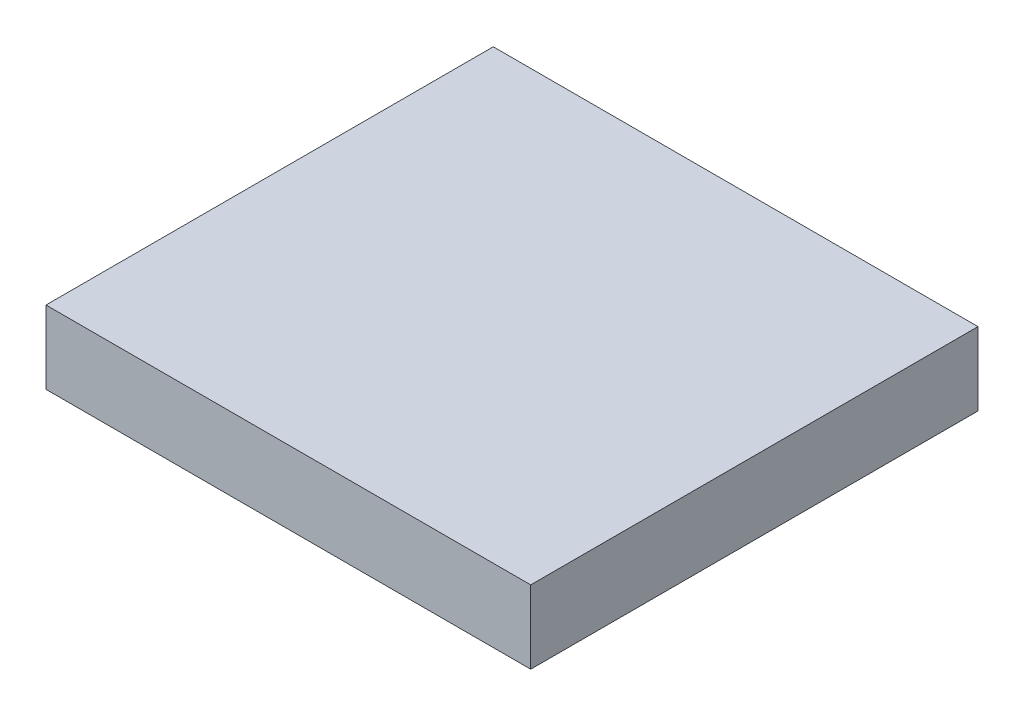
ISO-10303-21;
HEADER;
FILE_DESCRIPTION(('STEP AP214'),'2;1');
FILE_NAME('part.step','',(''),(''),'','','');
FILE_SCHEMA(('AUTOMOTIVE_DESIGN { 1 0 10303 214 1 1 1 1 }'));
ENDSEC;
DATA;
#1=APPLICATION_CONTEXT('core data for automotive mechanical design processes');
#2=APPLICATION_PROTOCOL_DEFINITION('international standard','automotive_design',2000,#1);
#3=PRODUCT_CONTEXT('',#1,'mechanical');
#4=PRODUCT('Part','Part','',(#3));
#5=PRODUCT_RELATED_PRODUCT_CATEGORY('part','',(#4));
#6=PRODUCT_DEFINITION_FORMATION('','',#4);
#7=PRODUCT_DEFINITION_CONTEXT('part definition',#1,'design');
#8=PRODUCT_DEFINITION('design','',#6,#7);
#9=PRODUCT_DEFINITION_SHAPE('','',#8);
#10=(LENGTH_UNIT() NAMED_UNIT(*) SI_UNIT(.MILLI.,.METRE.));
#11=(NAMED_UNIT(*) PLANE_ANGLE_UNIT() SI_UNIT($,.RADIAN.));
#12=(NAMED_UNIT(*) SI_UNIT($,.STERADIAN.) SOLID_ANGLE_UNIT());
#13=UNCERTAINTY_MEASURE_WITH_UNIT(LENGTH_MEASURE(1.E-05),#10,'distance_accuracy_value','');
#14=(GEOMETRIC_REPRESENTATION_CONTEXT(3) GLOBAL_UNCERTAINTY_ASSIGNED_CONTEXT((#13)) GLOBAL_UNIT_ASSIGNED_CONTEXT((#10,
#11,#12)) REPRESENTATION_CONTEXT('',''));
#15=CARTESIAN_POINT('',(0.,0.,0.));
#16=DIRECTION('',(0.,0.,1.));
#17=DIRECTION('',(1.,0.,0.));
#18=AXIS2_PLACEMENT_3D('',#15,#16,#17);
#19=CARTESIAN_POINT('',(-1.35999982,-0.20498308,0.));
#20=DIRECTION('',(1.21397755027438E-05,0.999999999926313,0.));
#21=DIRECTION('',(-0.999999999926313,1.21397755027438E-05,0.));
#22=AXIS2_PLACEMENT_3D('',#19,#20,#21);
#23=PLANE('',#22);
#24=DIRECTION('',(0.,0.,-1.));
#25=VECTOR('',#24,1.);
#26=CARTESIAN_POINT('',(1.36000236,-0.205016100215835,0.));
#27=LINE('',#26,#25);
#28=CARTESIAN_POINT('',(1.35999347,-0.204999589999997,2.51000006));
#29=VERTEX_POINT('',#28);
#30=CARTESIAN_POINT('',(1.35999347,-0.204999589999997,0.));
#31=VERTEX_POINT('',#30);
#32=EDGE_CURVE('E63',#29,#31,#27,.T.);
#33=ORIENTED_EDGE('',*,*,#32,.F.);
#34=DIRECTION('',(-0.999999999926313,1.21397755066437E-05,0.));
#35=VECTOR('',#34,1.);
#36=CARTESIAN_POINT('',(1.35998458,-0.2050161,2.51000006));
#37=LINE('',#36,#35);
#38=CARTESIAN_POINT('',(-1.35999982,-0.20498308,2.51000006));
#39=VERTEX_POINT('',#38);
#40=EDGE_CURVE('E76',#29,#39,#37,.T.);
#41=ORIENTED_EDGE('',*,*,#40,.T.);
#42=DIRECTION('',(0.,0.,1.));
#43=VECTOR('',#42,1.);
#44=CARTESIAN_POINT('',(-1.35999982,-0.20498308,0.));
#45=LINE('',#44,#43);
#46=CARTESIAN_POINT('',(-1.35999982,-0.20498308,0.));
#47=VERTEX_POINT('',#46);
#48=EDGE_CURVE('E59',#39,#47,#45,.F.);
#49=ORIENTED_EDGE('',*,*,#48,.T.);
#50=DIRECTION('',(-0.999999999926313,1.21397755066437E-05,0.));
#51=VECTOR('',#50,1.);
#52=CARTESIAN_POINT('',(1.35998458,-0.2050161,0.));
#53=LINE('',#52,#51);
#54=EDGE_CURVE('E55',#31,#47,#53,.T.);
#55=ORIENTED_EDGE('',*,*,#54,.F.);
#56=EDGE_LOOP('',(#33,#41,#49,#55));
#57=FACE_BOUND('',#56,.T.);
#58=ADVANCED_FACE('F16',(#57),#23,.F.);
#59=CARTESIAN_POINT('',(1.36000236,-0.00498601999999,0.));
#60=DIRECTION('',(-0.999999999926856,-1.20949696869183E-05,0.));
#61=DIRECTION('',(1.20949696869183E-05,-0.999999999926856,0.));
#62=AXIS2_PLACEMENT_3D('',#59,#60,#61);
#63=PLANE('',#62);
#64=DIRECTION('',(0.,0.,-1.));
#65=VECTOR('',#64,1.);
#66=CARTESIAN_POINT('',(1.35999982,0.20501864,0.));
#67=LINE('',#66,#65);
#68=CARTESIAN_POINT('',(1.35999982,0.20501864,0.));
#69=VERTEX_POINT('',#68);
#70=CARTESIAN_POINT('',(1.35999982,0.20501864,2.51000006));
#71=VERTEX_POINT('',#70);
#72=EDGE_CURVE('E70',#69,#71,#67,.F.);
#73=ORIENTED_EDGE('',*,*,#72,.T.);
#74=DIRECTION('',(0.,1.,0.));
#75=VECTOR('',#74,1.);
#76=CARTESIAN_POINT('',(1.35999982,0.20501864,2.51000006));
#77=LINE('',#76,#75);
#78=EDGE_CURVE('E65',#71,#29,#77,.F.);
#79=ORIENTED_EDGE('',*,*,#78,.T.);
#80=ORIENTED_EDGE('',*,*,#32,.T.);
#81=DIRECTION('',(0.,1.,0.));
#82=VECTOR('',#81,1.);
#83=CARTESIAN_POINT('',(1.35999982,0.20501864,0.));
#84=LINE('',#83,#82);
#85=EDGE_CURVE('E51',#69,#31,#84,.F.);
#86=ORIENTED_EDGE('',*,*,#85,.F.);
#87=EDGE_LOOP('',(#73,#79,#80,#86));
#88=FACE_BOUND('',#87,.T.);
#89=ADVANCED_FACE('F64',(#88),#63,.F.);
#90=CARTESIAN_POINT('',(-1.35999728,0.20501864,2.51000006));
#91=DIRECTION('',(0.,0.,-1.));
#92=DIRECTION('',(-1.,0.,0.));
#93=AXIS2_PLACEMENT_3D('',#90,#91,#92);
#94=PLANE('',#93);
#95=ORIENTED_EDGE('',*,*,#40,.F.);
#96=ORIENTED_EDGE('',*,*,#78,.F.);
#97=DIRECTION('',(1.,0.,0.));
#98=VECTOR('',#97,1.);
#99=CARTESIAN_POINT('',(1.35999982,0.20501864,2.51000006));
#100=LINE('',#99,#98);
#101=CARTESIAN_POINT('',(-1.35999728,0.205018639992132,2.51000006));
#102=VERTEX_POINT('',#101);
#103=EDGE_CURVE('E92',#71,#102,#100,.F.);
#104=ORIENTED_EDGE('',*,*,#103,.T.);
#105=DIRECTION('',(6.19509595459283E-06,0.99999999998081,0.));
#106=VECTOR('',#105,1.);
#107=CARTESIAN_POINT('',(-1.35999728,0.20501864,2.51000006));
#108=LINE('',#107,#106);
#109=EDGE_CURVE('E78',#102,#39,#108,.F.);
#110=ORIENTED_EDGE('',*,*,#109,.T.);
#111=EDGE_LOOP('',(#95,#96,#104,#110));
#112=FACE_BOUND('',#111,.T.);
#113=ADVANCED_FACE('F110',(#112),#94,.F.);
#114=CARTESIAN_POINT('',(-1.35999728,0.20501864,0.));
#115=DIRECTION('',(0.99999999998081,-6.19509595459283E-06,0.));
#116=DIRECTION('',(6.19509595459283E-06,0.99999999998081,0.));
#117=AXIS2_PLACEMENT_3D('',#114,#115,#116);
#118=PLANE('',#117);
#119=ORIENTED_EDGE('',*,*,#48,.F.);
#120=ORIENTED_EDGE('',*,*,#109,.F.);
#121=DIRECTION('',(0.,0.,-1.));
#122=VECTOR('',#121,1.);
#123=CARTESIAN_POINT('',(-1.35999728,0.20501864,0.));
#124=LINE('',#123,#122);
#125=CARTESIAN_POINT('',(-1.359997915,0.20501864,0.));
#126=VERTEX_POINT('',#125);
#127=EDGE_CURVE('E25',#102,#126,#124,.T.);
#128=ORIENTED_EDGE('',*,*,#127,.T.);
#129=DIRECTION('',(0.,1.,0.));
#130=VECTOR('',#129,1.);
#131=CARTESIAN_POINT('',(-1.35999982,0.20501864,0.));
#132=LINE('',#131,#130);
#133=EDGE_CURVE('E33',#47,#126,#132,.T.);
#134=ORIENTED_EDGE('',*,*,#133,.F.);
#135=EDGE_LOOP('',(#119,#120,#128,#134));
#136=FACE_BOUND('',#135,.T.);
#137=ADVANCED_FACE('F109',(#136),#118,.F.);
#138=CARTESIAN_POINT('',(-1.35999728,0.20501864,0.));
#139=DIRECTION('',(0.,0.,-1.));
#140=DIRECTION('',(-1.,0.,0.));
#141=AXIS2_PLACEMENT_3D('',#138,#139,#140);
#142=PLANE('',#141);
#143=ORIENTED_EDGE('',*,*,#54,.T.);
#144=ORIENTED_EDGE('',*,*,#133,.T.);
#145=DIRECTION('',(1.,0.,0.));
#146=VECTOR('',#145,1.);
#147=CARTESIAN_POINT('',(1.35999982,0.20501864,0.));
#148=LINE('',#147,#146);
#149=EDGE_CURVE('E11',#126,#69,#148,.T.);
#150=ORIENTED_EDGE('',*,*,#149,.T.);
#151=ORIENTED_EDGE('',*,*,#85,.T.);
#152=EDGE_LOOP('',(#143,#144,#150,#151));
#153=FACE_BOUND('',#152,.T.);
#154=ADVANCED_FACE('F53',(#153),#142,.T.);
#155=CARTESIAN_POINT('',(1.35999982,0.20501864,0.));
#156=DIRECTION('',(0.,-1.,0.));
#157=DIRECTION('',(0.,0.,-1.));
#158=AXIS2_PLACEMENT_3D('',#155,#156,#157);
#159=PLANE('',#158);
#160=ORIENTED_EDGE('',*,*,#127,.F.);
#161=ORIENTED_EDGE('',*,*,#103,.F.);
#162=ORIENTED_EDGE('',*,*,#72,.F.);
#163=ORIENTED_EDGE('',*,*,#149,.F.);
#164=EDGE_LOOP('',(#160,#161,#162,#163));
#165=FACE_BOUND('',#164,.T.);
#166=ADVANCED_FACE('F107',(#165),#159,.F.);
#167=CLOSED_SHELL('',(#58,#89,#113,#137,#154,#166));
#168=MANIFOLD_SOLID_BREP('B1',#167);
#169=ADVANCED_BREP_SHAPE_REPRESENTATION('',(#18,#168),#14);
#170=SHAPE_DEFINITION_REPRESENTATION(#9,#169);
ENDSEC;
END-ISO-10303-21;
